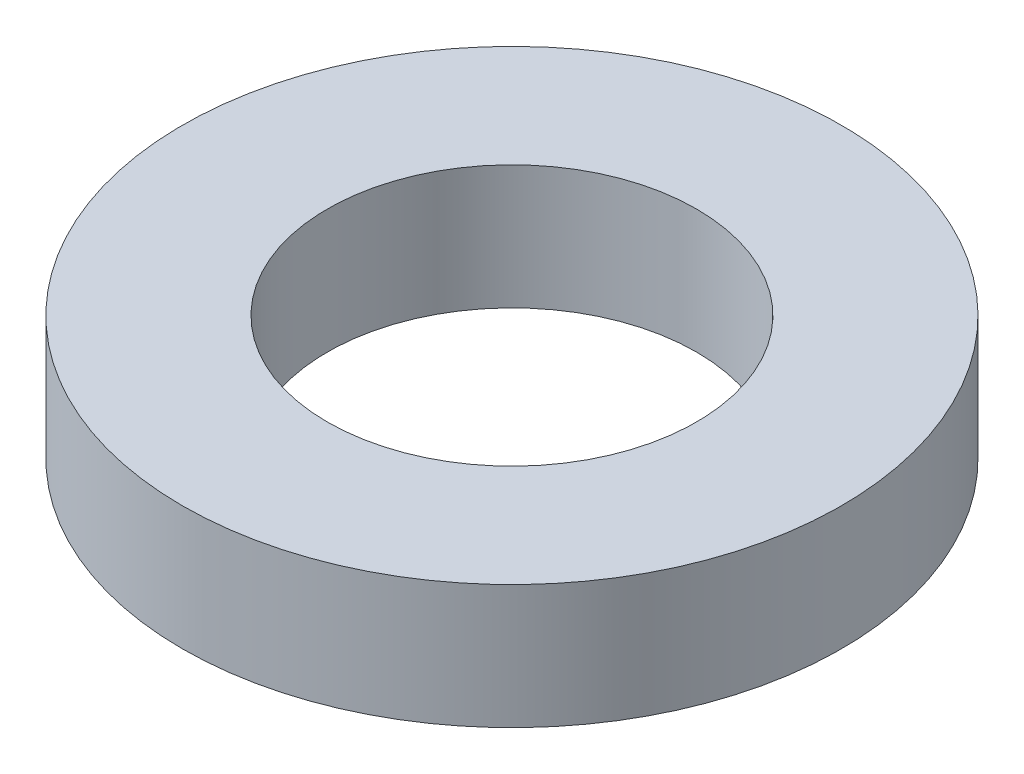
ISO-10303-21;
HEADER;
FILE_DESCRIPTION(('STEP AP214'),'2;1');
FILE_NAME('part.step','',(''),(''),'','','');
FILE_SCHEMA(('AUTOMOTIVE_DESIGN { 1 0 10303 214 1 1 1 1 }'));
ENDSEC;
DATA;
#1=APPLICATION_CONTEXT('core data for automotive mechanical design processes');
#2=APPLICATION_PROTOCOL_DEFINITION('international standard','automotive_design',2000,#1);
#3=PRODUCT_CONTEXT('',#1,'mechanical');
#4=PRODUCT('Part','Part','',(#3));
#5=PRODUCT_RELATED_PRODUCT_CATEGORY('part','',(#4));
#6=PRODUCT_DEFINITION_FORMATION('','',#4);
#7=PRODUCT_DEFINITION_CONTEXT('part definition',#1,'design');
#8=PRODUCT_DEFINITION('design','',#6,#7);
#9=PRODUCT_DEFINITION_SHAPE('','',#8);
#10=(LENGTH_UNIT() NAMED_UNIT(*) SI_UNIT(.MILLI.,.METRE.));
#11=(NAMED_UNIT(*) PLANE_ANGLE_UNIT() SI_UNIT($,.RADIAN.));
#12=(NAMED_UNIT(*) SI_UNIT($,.STERADIAN.) SOLID_ANGLE_UNIT());
#13=UNCERTAINTY_MEASURE_WITH_UNIT(LENGTH_MEASURE(1.E-05),#10,'distance_accuracy_value','');
#14=(GEOMETRIC_REPRESENTATION_CONTEXT(3) GLOBAL_UNCERTAINTY_ASSIGNED_CONTEXT((#13)) GLOBAL_UNIT_ASSIGNED_CONTEXT((#10,
#11,#12)) REPRESENTATION_CONTEXT('',''));
#15=CARTESIAN_POINT('',(0.,0.,0.));
#16=DIRECTION('',(0.,0.,1.));
#17=DIRECTION('',(1.,0.,0.));
#18=AXIS2_PLACEMENT_3D('',#15,#16,#17);
#19=CARTESIAN_POINT('',(0.,1.1938,0.));
#20=DIRECTION('',(0.,-1.,0.));
#21=DIRECTION('',(0.,0.,-1.));
#22=AXIS2_PLACEMENT_3D('',#19,#20,#21);
#23=CYLINDRICAL_SURFACE('',#22,3.175);
#24=CARTESIAN_POINT('',(0.,1.1938,0.));
#25=DIRECTION('',(0.,1.,0.));
#26=DIRECTION('',(0.,0.,1.));
#27=AXIS2_PLACEMENT_3D('',#24,#25,#26);
#28=CIRCLE('',#27,3.175);
#29=CARTESIAN_POINT('',(0.,1.1938,3.175));
#30=VERTEX_POINT('',#29);
#31=EDGE_CURVE('E10',#30,#30,#28,.T.);
#32=ORIENTED_EDGE('',*,*,#31,.F.);
#33=EDGE_LOOP('',(#32));
#34=FACE_BOUND('',#33,.T.);
#35=CARTESIAN_POINT('',(0.,0.,0.));
#36=DIRECTION('',(0.,1.,0.));
#37=DIRECTION('',(0.,0.,1.));
#38=AXIS2_PLACEMENT_3D('',#35,#36,#37);
#39=CIRCLE('',#38,3.175);
#40=CARTESIAN_POINT('',(0.,0.,3.175));
#41=VERTEX_POINT('',#40);
#42=EDGE_CURVE('E31',#41,#41,#39,.T.);
#43=ORIENTED_EDGE('',*,*,#42,.T.);
#44=EDGE_LOOP('',(#43));
#45=FACE_BOUND('',#44,.T.);
#46=ADVANCED_FACE('F25',(#34,#45),#23,.T.);
#47=CARTESIAN_POINT('',(0.,1.1938,0.));
#48=DIRECTION('',(0.,1.,0.));
#49=DIRECTION('',(0.,0.,1.));
#50=AXIS2_PLACEMENT_3D('',#47,#48,#49);
#51=PLANE('',#50);
#52=CARTESIAN_POINT('',(0.,1.1938,0.));
#53=DIRECTION('',(0.,1.,0.));
#54=DIRECTION('',(0.,0.,1.));
#55=AXIS2_PLACEMENT_3D('',#52,#53,#54);
#56=CIRCLE('',#55,1.778);
#57=CARTESIAN_POINT('',(0.,1.1938,1.778));
#58=VERTEX_POINT('',#57);
#59=EDGE_CURVE('E39',#58,#58,#56,.T.);
#60=ORIENTED_EDGE('',*,*,#59,.F.);
#61=EDGE_LOOP('',(#60));
#62=FACE_BOUND('',#61,.T.);
#63=ORIENTED_EDGE('',*,*,#31,.T.);
#64=EDGE_LOOP('',(#63));
#65=FACE_BOUND('',#64,.T.);
#66=ADVANCED_FACE('F47',(#62,#65),#51,.T.);
#67=CARTESIAN_POINT('',(0.,0.,0.));
#68=DIRECTION('',(0.,1.,0.));
#69=DIRECTION('',(0.,0.,1.));
#70=AXIS2_PLACEMENT_3D('',#67,#68,#69);
#71=PLANE('',#70);
#72=CARTESIAN_POINT('',(0.,0.,0.));
#73=DIRECTION('',(0.,1.,0.));
#74=DIRECTION('',(0.,0.,1.));
#75=AXIS2_PLACEMENT_3D('',#72,#73,#74);
#76=CIRCLE('',#75,1.778);
#77=CARTESIAN_POINT('',(0.,0.,1.778));
#78=VERTEX_POINT('',#77);
#79=EDGE_CURVE('E35',#78,#78,#76,.T.);
#80=ORIENTED_EDGE('',*,*,#79,.T.);
#81=EDGE_LOOP('',(#80));
#82=FACE_BOUND('',#81,.T.);
#83=ORIENTED_EDGE('',*,*,#42,.F.);
#84=EDGE_LOOP('',(#83));
#85=FACE_BOUND('',#84,.T.);
#86=ADVANCED_FACE('F49',(#82,#85),#71,.F.);
#87=CARTESIAN_POINT('',(0.,0.,0.));
#88=DIRECTION('',(0.,1.,0.));
#89=DIRECTION('',(0.,0.,1.));
#90=AXIS2_PLACEMENT_3D('',#87,#88,#89);
#91=CYLINDRICAL_SURFACE('',#90,1.778);
#92=ORIENTED_EDGE('',*,*,#79,.F.);
#93=EDGE_LOOP('',(#92));
#94=FACE_BOUND('',#93,.T.);
#95=ORIENTED_EDGE('',*,*,#59,.T.);
#96=EDGE_LOOP('',(#95));
#97=FACE_BOUND('',#96,.T.);
#98=ADVANCED_FACE('F45',(#94,#97),#91,.F.);
#99=CLOSED_SHELL('',(#46,#66,#86,#98));
#100=MANIFOLD_SOLID_BREP('B2',#99);
#101=ADVANCED_BREP_SHAPE_REPRESENTATION('',(#18,#100),#14);
#102=SHAPE_DEFINITION_REPRESENTATION(#9,#101);
ENDSEC;
END-ISO-10303-21;
